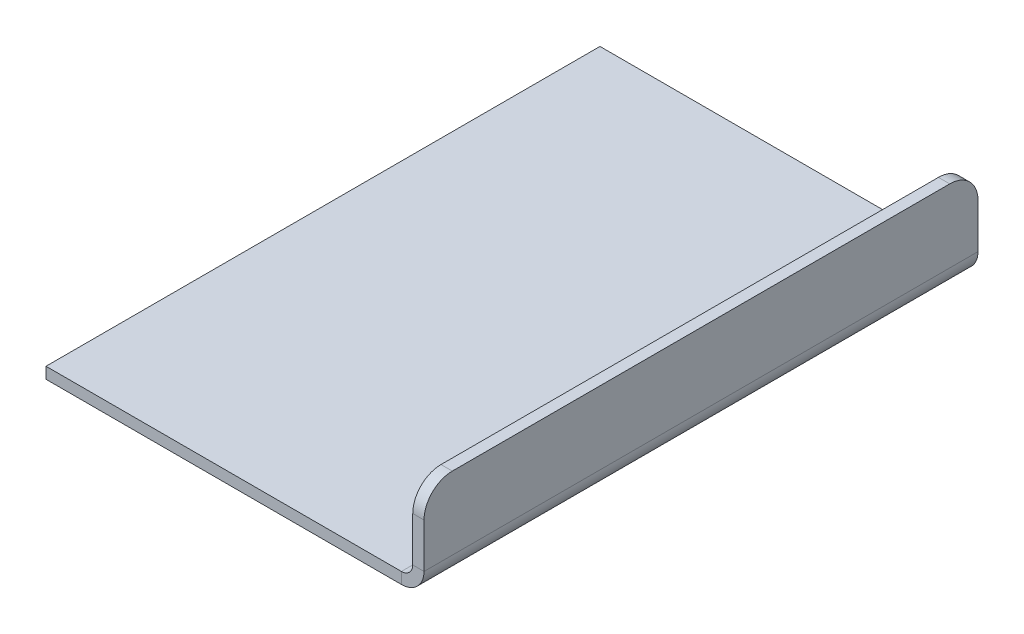
ISO-10303-21;
HEADER;
FILE_DESCRIPTION(('STEP AP214'),'2;1');
FILE_NAME('part.step','',(''),(''),'','','');
FILE_SCHEMA(('AUTOMOTIVE_DESIGN { 1 0 10303 214 1 1 1 1 }'));
ENDSEC;
DATA;
#1=APPLICATION_CONTEXT('core data for automotive mechanical design processes');
#2=APPLICATION_PROTOCOL_DEFINITION('international standard','automotive_design',2000,#1);
#3=PRODUCT_CONTEXT('',#1,'mechanical');
#4=PRODUCT('Part','Part','',(#3));
#5=PRODUCT_RELATED_PRODUCT_CATEGORY('part','',(#4));
#6=PRODUCT_DEFINITION_FORMATION('','',#4);
#7=PRODUCT_DEFINITION_CONTEXT('part definition',#1,'design');
#8=PRODUCT_DEFINITION('design','',#6,#7);
#9=PRODUCT_DEFINITION_SHAPE('','',#8);
#10=(LENGTH_UNIT() NAMED_UNIT(*) SI_UNIT(.MILLI.,.METRE.));
#11=(NAMED_UNIT(*) PLANE_ANGLE_UNIT() SI_UNIT($,.RADIAN.));
#12=(NAMED_UNIT(*) SI_UNIT($,.STERADIAN.) SOLID_ANGLE_UNIT());
#13=UNCERTAINTY_MEASURE_WITH_UNIT(LENGTH_MEASURE(1.E-05),#10,'distance_accuracy_value','');
#14=(GEOMETRIC_REPRESENTATION_CONTEXT(3) GLOBAL_UNCERTAINTY_ASSIGNED_CONTEXT((#13)) GLOBAL_UNIT_ASSIGNED_CONTEXT((#10,
#11,#12)) REPRESENTATION_CONTEXT('',''));
#15=CARTESIAN_POINT('',(0.,0.,0.));
#16=DIRECTION('',(0.,0.,1.));
#17=DIRECTION('',(1.,0.,0.));
#18=AXIS2_PLACEMENT_3D('',#15,#16,#17);
#19=CARTESIAN_POINT('',(64.8794249588274,-65.1205750411732,49.0000000000003));
#20=DIRECTION('',(0.,0.,-1.));
#21=DIRECTION('',(0.,-1.,0.));
#22=AXIS2_PLACEMENT_3D('',#19,#20,#21);
#23=PLANE('',#22);
#24=DIRECTION('',(0.,1.,0.));
#25=VECTOR('',#24,1.);
#26=CARTESIAN_POINT('',(64.8794249588274,-65.1205750411732,49.0000000000003));
#27=LINE('',#26,#25);
#28=CARTESIAN_POINT('',(64.8794249588269,2.,49.0000000000003));
#29=VERTEX_POINT('',#28);
#30=CARTESIAN_POINT('',(64.8794249588269,9.87942495882677,49.0000000000003));
#31=VERTEX_POINT('',#30);
#32=EDGE_CURVE('E45',#29,#31,#27,.T.);
#33=ORIENTED_EDGE('',*,*,#32,.F.);
#34=DIRECTION('',(1.,0.,0.));
#35=VECTOR('',#34,1.);
#36=CARTESIAN_POINT('',(64.8794249588269,2.,49.0000000000003));
#37=LINE('',#36,#35);
#38=CARTESIAN_POINT('',(66.8794249588269,1.99999999999967,49.0000000000004));
#39=VERTEX_POINT('',#38);
#40=EDGE_CURVE('E12',#29,#39,#37,.T.);
#41=ORIENTED_EDGE('',*,*,#40,.T.);
#42=DIRECTION('',(0.,1.,0.));
#43=VECTOR('',#42,1.);
#44=CARTESIAN_POINT('',(66.8794249588274,-65.1205750411732,49.0000000000003));
#45=LINE('',#44,#43);
#46=CARTESIAN_POINT('',(66.8794249588269,9.87942495882654,49.0000000000003));
#47=VERTEX_POINT('',#46);
#48=EDGE_CURVE('E58',#39,#47,#45,.T.);
#49=ORIENTED_EDGE('',*,*,#48,.T.);
#50=DIRECTION('',(1.,0.,0.));
#51=VECTOR('',#50,1.);
#52=CARTESIAN_POINT('',(64.8794249588269,9.87942495882677,49.0000000000003));
#53=LINE('',#52,#51);
#54=EDGE_CURVE('E189',#47,#31,#53,.F.);
#55=ORIENTED_EDGE('',*,*,#54,.T.);
#56=EDGE_LOOP('',(#33,#41,#49,#55));
#57=FACE_BOUND('',#56,.T.);
#58=ADVANCED_FACE('F42',(#57),#23,.F.);
#59=CARTESIAN_POINT('',(66.8794249588274,-65.1205750411732,49.0000000000003));
#60=DIRECTION('',(-1.,0.,0.));
#61=DIRECTION('',(0.,0.,1.));
#62=AXIS2_PLACEMENT_3D('',#59,#60,#61);
#63=PLANE('',#62);
#64=ORIENTED_EDGE('',*,*,#48,.F.);
#65=DIRECTION('',(0.,0.,-1.));
#66=VECTOR('',#65,1.);
#67=CARTESIAN_POINT('',(66.8794249588269,1.99999999999978,49.0000000000004));
#68=LINE('',#67,#66);
#69=CARTESIAN_POINT('',(66.8794249588271,1.99999999999967,-49.));
#70=VERTEX_POINT('',#69);
#71=EDGE_CURVE('E50',#39,#70,#68,.T.);
#72=ORIENTED_EDGE('',*,*,#71,.T.);
#73=DIRECTION('',(0.,1.,0.));
#74=VECTOR('',#73,1.);
#75=CARTESIAN_POINT('',(66.8794249588274,-65.1205750411731,-49.));
#76=LINE('',#75,#74);
#77=CARTESIAN_POINT('',(66.8794249588271,9.87942495882654,-49.));
#78=VERTEX_POINT('',#77);
#79=EDGE_CURVE('E65',#70,#78,#76,.T.);
#80=ORIENTED_EDGE('',*,*,#79,.T.);
#81=CARTESIAN_POINT('',(66.8794249588269,9.87942495882654,-43.9999999999999));
#82=DIRECTION('',(-1.,0.,0.));
#83=DIRECTION('',(0.,0.,1.));
#84=AXIS2_PLACEMENT_3D('',#81,#82,#83);
#85=CIRCLE('',#84,5.);
#86=CARTESIAN_POINT('',(66.8794249588267,14.8794249588265,-43.9999999999999));
#87=VERTEX_POINT('',#86);
#88=EDGE_CURVE('E177',#78,#87,#85,.F.);
#89=ORIENTED_EDGE('',*,*,#88,.T.);
#90=DIRECTION('',(0.,0.,-1.));
#91=VECTOR('',#90,1.);
#92=CARTESIAN_POINT('',(66.8794249588269,14.8794249588265,49.0000000000002));
#93=LINE('',#92,#91);
#94=CARTESIAN_POINT('',(66.8794249588266,14.8794249588265,44.0000000000002));
#95=VERTEX_POINT('',#94);
#96=EDGE_CURVE('E170',#95,#87,#93,.T.);
#97=ORIENTED_EDGE('',*,*,#96,.F.);
#98=CARTESIAN_POINT('',(66.8794249588268,9.87942495882654,44.0000000000003));
#99=DIRECTION('',(-1.,0.,0.));
#100=DIRECTION('',(0.,0.,1.));
#101=AXIS2_PLACEMENT_3D('',#98,#99,#100);
#102=CIRCLE('',#101,5.);
#103=EDGE_CURVE('E175',#95,#47,#102,.F.);
#104=ORIENTED_EDGE('',*,*,#103,.T.);
#105=EDGE_LOOP('',(#64,#72,#80,#89,#97,#104));
#106=FACE_BOUND('',#105,.T.);
#107=ADVANCED_FACE('F211',(#106),#63,.F.);
#108=CARTESIAN_POINT('',(64.8794249588268,14.8794249588268,49.0000000000003));
#109=DIRECTION('',(0.,1.,0.));
#110=DIRECTION('',(0.,0.,-1.));
#111=AXIS2_PLACEMENT_3D('',#108,#109,#110);
#112=PLANE('',#111);
#113=ORIENTED_EDGE('',*,*,#96,.T.);
#114=DIRECTION('',(1.,0.,0.));
#115=VECTOR('',#114,1.);
#116=CARTESIAN_POINT('',(64.8794249588266,14.8794249588265,-43.9999999999998));
#117=LINE('',#116,#115);
#118=CARTESIAN_POINT('',(64.8794249588266,14.8794249588265,-43.9999999999998));
#119=VERTEX_POINT('',#118);
#120=EDGE_CURVE('E182',#87,#119,#117,.F.);
#121=ORIENTED_EDGE('',*,*,#120,.T.);
#122=DIRECTION('',(0.,0.,-1.));
#123=VECTOR('',#122,1.);
#124=CARTESIAN_POINT('',(64.8794249588268,14.8794249588268,49.0000000000003));
#125=LINE('',#124,#123);
#126=CARTESIAN_POINT('',(64.8794249588266,14.8794249588265,44.0000000000002));
#127=VERTEX_POINT('',#126);
#128=EDGE_CURVE('E167',#127,#119,#125,.T.);
#129=ORIENTED_EDGE('',*,*,#128,.F.);
#130=DIRECTION('',(1.,0.,0.));
#131=VECTOR('',#130,1.);
#132=CARTESIAN_POINT('',(66.8794249588266,14.8794249588265,44.0000000000002));
#133=LINE('',#132,#131);
#134=EDGE_CURVE('E179',#127,#95,#133,.T.);
#135=ORIENTED_EDGE('',*,*,#134,.T.);
#136=EDGE_LOOP('',(#113,#121,#129,#135));
#137=FACE_BOUND('',#136,.T.);
#138=ADVANCED_FACE('F213',(#137),#112,.T.);
#139=CARTESIAN_POINT('',(64.8794249588274,-65.1205750411732,49.0000000000003));
#140=DIRECTION('',(-1.,0.,0.));
#141=DIRECTION('',(0.,0.,1.));
#142=AXIS2_PLACEMENT_3D('',#139,#140,#141);
#143=PLANE('',#142);
#144=DIRECTION('',(0.,0.,-1.));
#145=VECTOR('',#144,1.);
#146=CARTESIAN_POINT('',(64.8794249588269,2.,49.0000000000003));
#147=LINE('',#146,#145);
#148=CARTESIAN_POINT('',(64.8794249588271,1.99999999999956,-49.));
#149=VERTEX_POINT('',#148);
#150=EDGE_CURVE('E140',#29,#149,#147,.T.);
#151=ORIENTED_EDGE('',*,*,#150,.F.);
#152=ORIENTED_EDGE('',*,*,#32,.T.);
#153=CARTESIAN_POINT('',(64.8794249588269,9.87942495882654,44.0000000000002));
#154=DIRECTION('',(-1.,0.,0.));
#155=DIRECTION('',(0.,0.,1.));
#156=AXIS2_PLACEMENT_3D('',#153,#154,#155);
#157=CIRCLE('',#156,5.);
#158=EDGE_CURVE('E184',#31,#127,#157,.T.);
#159=ORIENTED_EDGE('',*,*,#158,.T.);
#160=ORIENTED_EDGE('',*,*,#128,.T.);
#161=CARTESIAN_POINT('',(64.8794249588269,9.87942495882654,-43.9999999999998));
#162=DIRECTION('',(-1.,0.,0.));
#163=DIRECTION('',(0.,0.,1.));
#164=AXIS2_PLACEMENT_3D('',#161,#162,#163);
#165=CIRCLE('',#164,5.);
#166=CARTESIAN_POINT('',(64.8794249588271,9.87942495882665,-48.9999999999999));
#167=VERTEX_POINT('',#166);
#168=EDGE_CURVE('E186',#119,#167,#165,.T.);
#169=ORIENTED_EDGE('',*,*,#168,.T.);
#170=DIRECTION('',(0.,1.,0.));
#171=VECTOR('',#170,1.);
#172=CARTESIAN_POINT('',(64.8794249588275,-65.1205750411735,-49.));
#173=LINE('',#172,#171);
#174=EDGE_CURVE('E197',#149,#167,#173,.T.);
#175=ORIENTED_EDGE('',*,*,#174,.F.);
#176=EDGE_LOOP('',(#151,#152,#159,#160,#169,#175));
#177=FACE_BOUND('',#176,.T.);
#178=ADVANCED_FACE('F204',(#177),#143,.T.);
#179=CARTESIAN_POINT('',(64.8794249588275,-65.1205750411735,-49.));
#180=DIRECTION('',(0.,0.,-1.));
#181=DIRECTION('',(0.,-1.,0.));
#182=AXIS2_PLACEMENT_3D('',#179,#180,#181);
#183=PLANE('',#182);
#184=DIRECTION('',(1.,0.,0.));
#185=VECTOR('',#184,1.);
#186=CARTESIAN_POINT('',(64.8794249588271,1.99999999999956,-49.));
#187=LINE('',#186,#185);
#188=EDGE_CURVE('E193',#149,#70,#187,.T.);
#189=ORIENTED_EDGE('',*,*,#188,.F.);
#190=ORIENTED_EDGE('',*,*,#174,.T.);
#191=DIRECTION('',(1.,0.,0.));
#192=VECTOR('',#191,1.);
#193=CARTESIAN_POINT('',(64.8794249588271,9.87942495882665,-48.9999999999999));
#194=LINE('',#193,#192);
#195=EDGE_CURVE('E173',#167,#78,#194,.T.);
#196=ORIENTED_EDGE('',*,*,#195,.T.);
#197=ORIENTED_EDGE('',*,*,#79,.F.);
#198=EDGE_LOOP('',(#189,#190,#196,#197));
#199=FACE_BOUND('',#198,.T.);
#200=ADVANCED_FACE('F200',(#199),#183,.T.);
#201=CARTESIAN_POINT('',(64.8794249588269,9.87942495882654,-43.9999999999998));
#202=DIRECTION('',(1.,0.,0.));
#203=DIRECTION('',(0.,0.,-1.));
#204=AXIS2_PLACEMENT_3D('',#201,#202,#203);
#205=CYLINDRICAL_SURFACE('',#204,5.);
#206=ORIENTED_EDGE('',*,*,#168,.F.);
#207=ORIENTED_EDGE('',*,*,#120,.F.);
#208=ORIENTED_EDGE('',*,*,#88,.F.);
#209=ORIENTED_EDGE('',*,*,#195,.F.);
#210=EDGE_LOOP('',(#206,#207,#208,#209));
#211=FACE_BOUND('',#210,.T.);
#212=ADVANCED_FACE('F209',(#211),#205,.T.);
#213=CARTESIAN_POINT('',(64.8794249588269,9.87942495882654,44.0000000000002));
#214=DIRECTION('',(-1.,0.,0.));
#215=DIRECTION('',(0.,0.,1.));
#216=AXIS2_PLACEMENT_3D('',#213,#214,#215);
#217=CYLINDRICAL_SURFACE('',#216,5.);
#218=ORIENTED_EDGE('',*,*,#158,.F.);
#219=ORIENTED_EDGE('',*,*,#54,.F.);
#220=ORIENTED_EDGE('',*,*,#103,.F.);
#221=ORIENTED_EDGE('',*,*,#134,.F.);
#222=EDGE_LOOP('',(#218,#219,#220,#221));
#223=FACE_BOUND('',#222,.T.);
#224=ADVANCED_FACE('F217',(#223),#217,.T.);
#225=CARTESIAN_POINT('',(0.,-2.00000000000045,49.0000000000002));
#226=DIRECTION('',(-1.,0.,0.));
#227=DIRECTION('',(0.,0.,1.));
#228=AXIS2_PLACEMENT_3D('',#225,#226,#227);
#229=PLANE('',#228);
#230=DIRECTION('',(0.,1.,0.));
#231=VECTOR('',#230,1.);
#232=CARTESIAN_POINT('',(0.,-1.99999999999989,-48.9999999999999));
#233=LINE('',#232,#231);
#234=CARTESIAN_POINT('',(0.,-1.99999999999989,-48.9999999999999));
#235=VERTEX_POINT('',#234);
#236=CARTESIAN_POINT('',(0.,1.11022302462516E-13,-48.9999999999999));
#237=VERTEX_POINT('',#236);
#238=EDGE_CURVE('E130',#235,#237,#233,.T.);
#239=ORIENTED_EDGE('',*,*,#238,.F.);
#240=DIRECTION('',(0.,0.,-1.));
#241=VECTOR('',#240,1.);
#242=CARTESIAN_POINT('',(0.,-2.00000000000045,49.0000000000002));
#243=LINE('',#242,#241);
#244=CARTESIAN_POINT('',(0.,-2.00000000000045,49.0000000000002));
#245=VERTEX_POINT('',#244);
#246=EDGE_CURVE('E239',#245,#235,#243,.T.);
#247=ORIENTED_EDGE('',*,*,#246,.F.);
#248=DIRECTION('',(0.,1.,0.));
#249=VECTOR('',#248,1.);
#250=CARTESIAN_POINT('',(0.,-2.00000000000045,49.0000000000002));
#251=LINE('',#250,#249);
#252=CARTESIAN_POINT('',(0.,-4.44089209850063E-13,49.0000000000002));
#253=VERTEX_POINT('',#252);
#254=EDGE_CURVE('E161',#245,#253,#251,.T.);
#255=ORIENTED_EDGE('',*,*,#254,.T.);
#256=DIRECTION('',(0.,0.,-1.));
#257=VECTOR('',#256,1.);
#258=CARTESIAN_POINT('',(0.,-4.44089209850063E-13,49.0000000000002));
#259=LINE('',#258,#257);
#260=EDGE_CURVE('E159',#253,#237,#259,.T.);
#261=ORIENTED_EDGE('',*,*,#260,.T.);
#262=EDGE_LOOP('',(#239,#247,#255,#261));
#263=FACE_BOUND('',#262,.T.);
#264=ADVANCED_FACE('F246',(#263),#229,.T.);
#265=CARTESIAN_POINT('',(0.,-4.44089209850063E-13,49.0000000000002));
#266=DIRECTION('',(0.,1.,0.));
#267=DIRECTION('',(0.,0.,1.));
#268=AXIS2_PLACEMENT_3D('',#265,#266,#267);
#269=PLANE('',#268);
#270=DIRECTION('',(1.,0.,0.));
#271=VECTOR('',#270,1.);
#272=CARTESIAN_POINT('',(0.,-4.44089209850063E-13,49.0000000000002));
#273=LINE('',#272,#271);
#274=CARTESIAN_POINT('',(62.8794249588271,0.,49.0000000000002));
#275=VERTEX_POINT('',#274);
#276=EDGE_CURVE('E150',#253,#275,#273,.T.);
#277=ORIENTED_EDGE('',*,*,#276,.T.);
#278=DIRECTION('',(0.,0.,-1.));
#279=VECTOR('',#278,1.);
#280=CARTESIAN_POINT('',(62.8794249588271,0.,49.0000000000002));
#281=LINE('',#280,#279);
#282=CARTESIAN_POINT('',(62.8794249588271,-1.11022302462516E-13,-49.));
#283=VERTEX_POINT('',#282);
#284=EDGE_CURVE('E138',#275,#283,#281,.T.);
#285=ORIENTED_EDGE('',*,*,#284,.T.);
#286=DIRECTION('',(1.,0.,0.));
#287=VECTOR('',#286,1.);
#288=CARTESIAN_POINT('',(0.,1.11022302462516E-13,-48.9999999999999));
#289=LINE('',#288,#287);
#290=EDGE_CURVE('E131',#237,#283,#289,.T.);
#291=ORIENTED_EDGE('',*,*,#290,.F.);
#292=ORIENTED_EDGE('',*,*,#260,.F.);
#293=EDGE_LOOP('',(#277,#285,#291,#292));
#294=FACE_BOUND('',#293,.T.);
#295=ADVANCED_FACE('F147',(#294),#269,.T.);
#296=CARTESIAN_POINT('',(0.,1.11022302462516E-13,-48.9999999999999));
#297=DIRECTION('',(0.,0.,-1.));
#298=DIRECTION('',(-1.,0.,0.));
#299=AXIS2_PLACEMENT_3D('',#296,#297,#298);
#300=PLANE('',#299);
#301=ORIENTED_EDGE('',*,*,#290,.T.);
#302=DIRECTION('',(0.,-1.,0.));
#303=VECTOR('',#302,1.);
#304=CARTESIAN_POINT('',(62.8794249588271,-1.11022302462516E-13,-49.));
#305=LINE('',#304,#303);
#306=CARTESIAN_POINT('',(62.8794249588271,-2.00000000000011,-49.));
#307=VERTEX_POINT('',#306);
#308=EDGE_CURVE('E119',#283,#307,#305,.T.);
#309=ORIENTED_EDGE('',*,*,#308,.T.);
#310=DIRECTION('',(1.,0.,0.));
#311=VECTOR('',#310,1.);
#312=CARTESIAN_POINT('',(0.,-1.99999999999989,-48.9999999999999));
#313=LINE('',#312,#311);
#314=EDGE_CURVE('E236',#235,#307,#313,.T.);
#315=ORIENTED_EDGE('',*,*,#314,.F.);
#316=ORIENTED_EDGE('',*,*,#238,.T.);
#317=EDGE_LOOP('',(#301,#309,#315,#316));
#318=FACE_BOUND('',#317,.T.);
#319=ADVANCED_FACE('F153',(#318),#300,.T.);
#320=CARTESIAN_POINT('',(0.,-2.00000000000045,49.0000000000002));
#321=DIRECTION('',(0.,1.,0.));
#322=DIRECTION('',(0.,0.,1.));
#323=AXIS2_PLACEMENT_3D('',#320,#321,#322);
#324=PLANE('',#323);
#325=DIRECTION('',(0.,0.,-1.));
#326=VECTOR('',#325,1.);
#327=CARTESIAN_POINT('',(62.8794249588269,-2.,49.0000000000003));
#328=LINE('',#327,#326);
#329=CARTESIAN_POINT('',(62.8794249588269,-2.,49.0000000000003));
#330=VERTEX_POINT('',#329);
#331=EDGE_CURVE('E164',#330,#307,#328,.T.);
#332=ORIENTED_EDGE('',*,*,#331,.F.);
#333=DIRECTION('',(1.,0.,0.));
#334=VECTOR('',#333,1.);
#335=CARTESIAN_POINT('',(0.,-2.00000000000045,49.0000000000002));
#336=LINE('',#335,#334);
#337=EDGE_CURVE('E198',#245,#330,#336,.T.);
#338=ORIENTED_EDGE('',*,*,#337,.F.);
#339=ORIENTED_EDGE('',*,*,#246,.T.);
#340=ORIENTED_EDGE('',*,*,#314,.T.);
#341=EDGE_LOOP('',(#332,#338,#339,#340));
#342=FACE_BOUND('',#341,.T.);
#343=ADVANCED_FACE('F243',(#342),#324,.F.);
#344=CARTESIAN_POINT('',(0.,-4.44089209850063E-13,49.0000000000002));
#345=DIRECTION('',(0.,0.,-1.));
#346=DIRECTION('',(-1.,0.,0.));
#347=AXIS2_PLACEMENT_3D('',#344,#345,#346);
#348=PLANE('',#347);
#349=DIRECTION('',(0.,-1.,0.));
#350=VECTOR('',#349,1.);
#351=CARTESIAN_POINT('',(62.8794249588271,0.,49.0000000000002));
#352=LINE('',#351,#350);
#353=EDGE_CURVE('E141',#275,#330,#352,.T.);
#354=ORIENTED_EDGE('',*,*,#353,.F.);
#355=ORIENTED_EDGE('',*,*,#276,.F.);
#356=ORIENTED_EDGE('',*,*,#254,.F.);
#357=ORIENTED_EDGE('',*,*,#337,.T.);
#358=EDGE_LOOP('',(#354,#355,#356,#357));
#359=FACE_BOUND('',#358,.T.);
#360=ADVANCED_FACE('F248',(#359),#348,.F.);
#361=CARTESIAN_POINT('',(62.8794249588269,2.,49.0000000000004));
#362=DIRECTION('',(0.,0.,-1.));
#363=DIRECTION('',(-1.,0.,0.));
#364=AXIS2_PLACEMENT_3D('',#361,#362,#363);
#365=PLANE('',#364);
#366=ORIENTED_EDGE('',*,*,#353,.T.);
#367=CARTESIAN_POINT('',(62.8794249588269,2.,49.0000000000004));
#368=DIRECTION('',(0.,0.,-1.));
#369=DIRECTION('',(-1.,0.,0.));
#370=AXIS2_PLACEMENT_3D('',#367,#368,#369);
#371=CIRCLE('',#370,4.);
#372=EDGE_CURVE('E228',#330,#39,#371,.F.);
#373=ORIENTED_EDGE('',*,*,#372,.T.);
#374=ORIENTED_EDGE('',*,*,#40,.F.);
#375=CARTESIAN_POINT('',(62.8794249588269,2.,49.0000000000004));
#376=DIRECTION('',(0.,0.,1.));
#377=DIRECTION('',(1.,0.,0.));
#378=AXIS2_PLACEMENT_3D('',#375,#376,#377);
#379=CIRCLE('',#378,1.99999999999999);
#380=EDGE_CURVE('E142',#275,#29,#379,.T.);
#381=ORIENTED_EDGE('',*,*,#380,.F.);
#382=EDGE_LOOP('',(#366,#373,#374,#381));
#383=FACE_BOUND('',#382,.T.);
#384=ADVANCED_FACE('F230',(#383),#365,.F.);
#385=CARTESIAN_POINT('',(62.8794249588271,1.99999999999989,-49.0000000000001));
#386=DIRECTION('',(0.,0.,1.));
#387=DIRECTION('',(1.,0.,0.));
#388=AXIS2_PLACEMENT_3D('',#385,#386,#387);
#389=PLANE('',#388);
#390=CARTESIAN_POINT('',(62.8794249588271,1.99999999999989,-49.0000000000001));
#391=DIRECTION('',(0.,0.,-1.));
#392=DIRECTION('',(-1.,0.,0.));
#393=AXIS2_PLACEMENT_3D('',#390,#391,#392);
#394=CIRCLE('',#393,4.);
#395=EDGE_CURVE('E125',#70,#307,#394,.T.);
#396=ORIENTED_EDGE('',*,*,#395,.T.);
#397=ORIENTED_EDGE('',*,*,#308,.F.);
#398=CARTESIAN_POINT('',(62.8794249588271,1.99999999999989,-49.0000000000001));
#399=DIRECTION('',(0.,0.,-1.));
#400=DIRECTION('',(1.,0.,0.));
#401=AXIS2_PLACEMENT_3D('',#398,#399,#400);
#402=CIRCLE('',#401,2.);
#403=EDGE_CURVE('E123',#149,#283,#402,.T.);
#404=ORIENTED_EDGE('',*,*,#403,.F.);
#405=ORIENTED_EDGE('',*,*,#188,.T.);
#406=EDGE_LOOP('',(#396,#397,#404,#405));
#407=FACE_BOUND('',#406,.T.);
#408=ADVANCED_FACE('F121',(#407),#389,.F.);
#409=CARTESIAN_POINT('',(62.8794249588269,2.00000000000011,98.1121162447388));
#410=DIRECTION('',(0.,0.,-1.));
#411=DIRECTION('',(-1.,0.,0.));
#412=AXIS2_PLACEMENT_3D('',#409,#410,#411);
#413=CYLINDRICAL_SURFACE('',#412,2.);
#414=ORIENTED_EDGE('',*,*,#150,.T.);
#415=ORIENTED_EDGE('',*,*,#403,.T.);
#416=ORIENTED_EDGE('',*,*,#284,.F.);
#417=ORIENTED_EDGE('',*,*,#380,.T.);
#418=EDGE_LOOP('',(#414,#415,#416,#417));
#419=FACE_BOUND('',#418,.T.);
#420=ADVANCED_FACE('F136',(#419),#413,.F.);
#421=CARTESIAN_POINT('',(62.8794249588269,2.00000000000011,98.1121162447388));
#422=DIRECTION('',(0.,0.,-1.));
#423=DIRECTION('',(-1.,0.,0.));
#424=AXIS2_PLACEMENT_3D('',#421,#422,#423);
#425=CYLINDRICAL_SURFACE('',#424,4.);
#426=ORIENTED_EDGE('',*,*,#71,.F.);
#427=ORIENTED_EDGE('',*,*,#372,.F.);
#428=ORIENTED_EDGE('',*,*,#331,.T.);
#429=ORIENTED_EDGE('',*,*,#395,.F.);
#430=EDGE_LOOP('',(#426,#427,#428,#429));
#431=FACE_BOUND('',#430,.T.);
#432=ADVANCED_FACE('F227',(#431),#425,.T.);
#433=CLOSED_SHELL('',(#58,#107,#138,#178,#200,#212,#224,#264,#295,#319,#343,#360,#384,#408,#420,#432));
#434=MANIFOLD_SOLID_BREP('B2',#433);
#435=ADVANCED_BREP_SHAPE_REPRESENTATION('',(#18,#434),#14);
#436=SHAPE_DEFINITION_REPRESENTATION(#9,#435);
ENDSEC;
END-ISO-10303-21;
